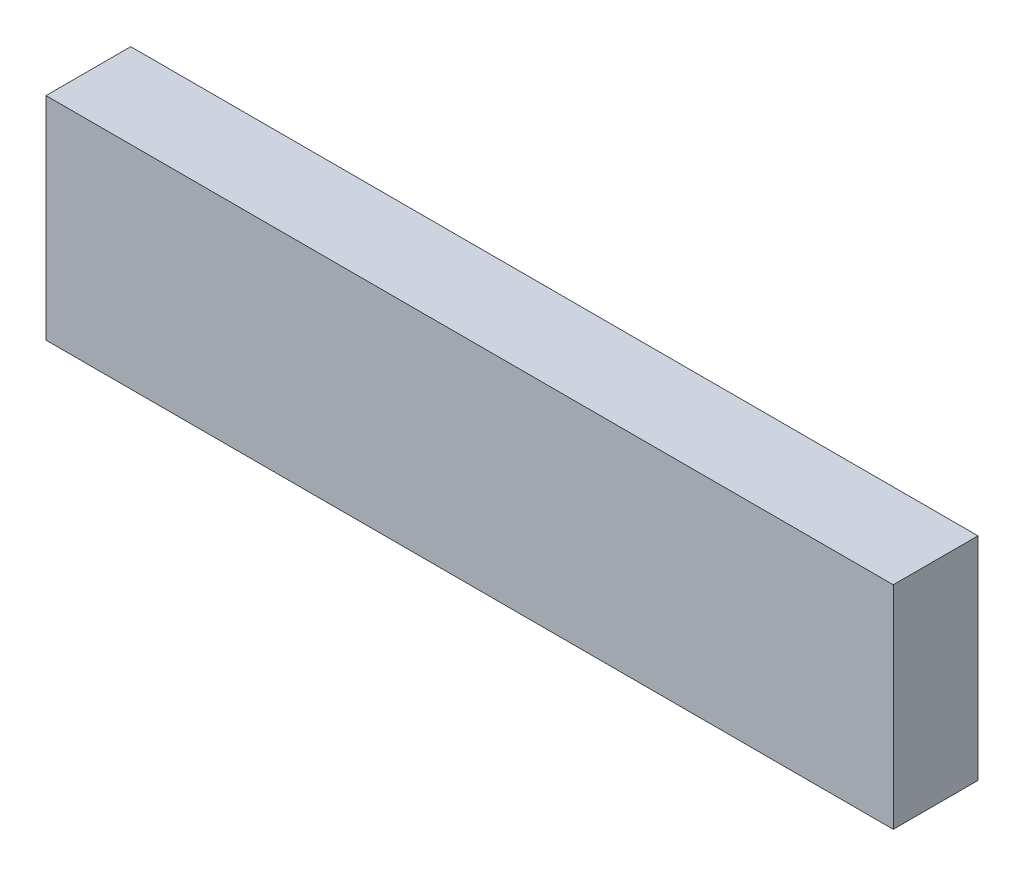
ISO-10303-21;
HEADER;
FILE_DESCRIPTION(('STEP AP214'),'2;1');
FILE_NAME('part.step','',(''),(''),'','','');
FILE_SCHEMA(('AUTOMOTIVE_DESIGN { 1 0 10303 214 1 1 1 1 }'));
ENDSEC;
DATA;
#1=APPLICATION_CONTEXT('core data for automotive mechanical design processes');
#2=APPLICATION_PROTOCOL_DEFINITION('international standard','automotive_design',2000,#1);
#3=PRODUCT_CONTEXT('',#1,'mechanical');
#4=PRODUCT('Part','Part','',(#3));
#5=PRODUCT_RELATED_PRODUCT_CATEGORY('part','',(#4));
#6=PRODUCT_DEFINITION_FORMATION('','',#4);
#7=PRODUCT_DEFINITION_CONTEXT('part definition',#1,'design');
#8=PRODUCT_DEFINITION('design','',#6,#7);
#9=PRODUCT_DEFINITION_SHAPE('','',#8);
#10=(LENGTH_UNIT() NAMED_UNIT(*) SI_UNIT(.MILLI.,.METRE.));
#11=(NAMED_UNIT(*) PLANE_ANGLE_UNIT() SI_UNIT($,.RADIAN.));
#12=(NAMED_UNIT(*) SI_UNIT($,.STERADIAN.) SOLID_ANGLE_UNIT());
#13=UNCERTAINTY_MEASURE_WITH_UNIT(LENGTH_MEASURE(1.E-05),#10,'distance_accuracy_value','');
#14=(GEOMETRIC_REPRESENTATION_CONTEXT(3) GLOBAL_UNCERTAINTY_ASSIGNED_CONTEXT((#13)) GLOBAL_UNIT_ASSIGNED_CONTEXT((#10,
#11,#12)) REPRESENTATION_CONTEXT('',''));
#15=CARTESIAN_POINT('',(0.,0.,0.));
#16=DIRECTION('',(0.,0.,1.));
#17=DIRECTION('',(1.,0.,0.));
#18=AXIS2_PLACEMENT_3D('',#15,#16,#17);
#19=CARTESIAN_POINT('',(-108.,46.99,55.8));
#20=DIRECTION('',(0.,0.,-1.));
#21=DIRECTION('',(-1.,0.,0.));
#22=AXIS2_PLACEMENT_3D('',#19,#20,#21);
#23=PLANE('',#22);
#24=DIRECTION('',(0.,1.,0.));
#25=VECTOR('',#24,1.);
#26=CARTESIAN_POINT('',(-96.,46.99,55.8));
#27=LINE('',#26,#25);
#28=CARTESIAN_POINT('',(-96.,47.,55.8));
#29=VERTEX_POINT('',#28);
#30=CARTESIAN_POINT('',(-96.,50.,55.8));
#31=VERTEX_POINT('',#30);
#32=EDGE_CURVE('E78',#29,#31,#27,.T.);
#33=ORIENTED_EDGE('',*,*,#32,.F.);
#34=DIRECTION('',(-1.,0.,0.));
#35=VECTOR('',#34,1.);
#36=CARTESIAN_POINT('',(300.,47.,55.8));
#37=LINE('',#36,#35);
#38=CARTESIAN_POINT('',(-108.,47.,55.8));
#39=VERTEX_POINT('',#38);
#40=EDGE_CURVE('E11',#29,#39,#37,.T.);
#41=ORIENTED_EDGE('',*,*,#40,.T.);
#42=DIRECTION('',(0.,1.,0.));
#43=VECTOR('',#42,1.);
#44=CARTESIAN_POINT('',(-108.,46.99,55.8));
#45=LINE('',#44,#43);
#46=CARTESIAN_POINT('',(-108.,50.,55.8));
#47=VERTEX_POINT('',#46);
#48=EDGE_CURVE('E39',#39,#47,#45,.T.);
#49=ORIENTED_EDGE('',*,*,#48,.T.);
#50=DIRECTION('',(1.,0.,0.));
#51=VECTOR('',#50,1.);
#52=CARTESIAN_POINT('',(-300.,50.,55.8));
#53=LINE('',#52,#51);
#54=EDGE_CURVE('E82',#47,#31,#53,.T.);
#55=ORIENTED_EDGE('',*,*,#54,.T.);
#56=EDGE_LOOP('',(#33,#41,#49,#55));
#57=FACE_BOUND('',#56,.T.);
#58=ADVANCED_FACE('F35',(#57),#23,.T.);
#59=CARTESIAN_POINT('',(-96.,46.99,55.8));
#60=DIRECTION('',(1.,0.,0.));
#61=DIRECTION('',(0.,0.,-1.));
#62=AXIS2_PLACEMENT_3D('',#59,#60,#61);
#63=PLANE('',#62);
#64=DIRECTION('',(0.,1.,0.));
#65=VECTOR('',#64,1.);
#66=CARTESIAN_POINT('',(-96.,46.99,57.));
#67=LINE('',#66,#65);
#68=CARTESIAN_POINT('',(-96.,47.,57.));
#69=VERTEX_POINT('',#68);
#70=CARTESIAN_POINT('',(-96.,50.,57.));
#71=VERTEX_POINT('',#70);
#72=EDGE_CURVE('E59',#69,#71,#67,.T.);
#73=ORIENTED_EDGE('',*,*,#72,.F.);
#74=DIRECTION('',(0.,0.,-1.));
#75=VECTOR('',#74,1.);
#76=CARTESIAN_POINT('',(-96.,47.,3.));
#77=LINE('',#76,#75);
#78=EDGE_CURVE('E44',#69,#29,#77,.T.);
#79=ORIENTED_EDGE('',*,*,#78,.T.);
#80=ORIENTED_EDGE('',*,*,#32,.T.);
#81=DIRECTION('',(0.,0.,1.));
#82=VECTOR('',#81,1.);
#83=CARTESIAN_POINT('',(-96.,50.,60.));
#84=LINE('',#83,#82);
#85=EDGE_CURVE('E98',#31,#71,#84,.T.);
#86=ORIENTED_EDGE('',*,*,#85,.T.);
#87=EDGE_LOOP('',(#73,#79,#80,#86));
#88=FACE_BOUND('',#87,.T.);
#89=ADVANCED_FACE('F91',(#88),#63,.T.);
#90=CARTESIAN_POINT('',(-108.,46.99,55.8));
#91=DIRECTION('',(-1.,0.,0.));
#92=DIRECTION('',(0.,0.,1.));
#93=AXIS2_PLACEMENT_3D('',#90,#91,#92);
#94=PLANE('',#93);
#95=ORIENTED_EDGE('',*,*,#48,.F.);
#96=DIRECTION('',(0.,0.,1.));
#97=VECTOR('',#96,1.);
#98=CARTESIAN_POINT('',(-108.,47.,3.));
#99=LINE('',#98,#97);
#100=CARTESIAN_POINT('',(-108.,47.,57.));
#101=VERTEX_POINT('',#100);
#102=EDGE_CURVE('E90',#39,#101,#99,.T.);
#103=ORIENTED_EDGE('',*,*,#102,.T.);
#104=DIRECTION('',(0.,1.,0.));
#105=VECTOR('',#104,1.);
#106=CARTESIAN_POINT('',(-108.,46.99,57.));
#107=LINE('',#106,#105);
#108=CARTESIAN_POINT('',(-108.,50.,57.));
#109=VERTEX_POINT('',#108);
#110=EDGE_CURVE('E52',#101,#109,#107,.T.);
#111=ORIENTED_EDGE('',*,*,#110,.T.);
#112=DIRECTION('',(0.,0.,-1.));
#113=VECTOR('',#112,1.);
#114=CARTESIAN_POINT('',(-108.,50.,60.));
#115=LINE('',#114,#113);
#116=EDGE_CURVE('E102',#109,#47,#115,.T.);
#117=ORIENTED_EDGE('',*,*,#116,.T.);
#118=EDGE_LOOP('',(#95,#103,#111,#117));
#119=FACE_BOUND('',#118,.T.);
#120=ADVANCED_FACE('F37',(#119),#94,.T.);
#121=CARTESIAN_POINT('',(-108.,46.99,57.));
#122=DIRECTION('',(0.,0.,1.));
#123=DIRECTION('',(1.,0.,0.));
#124=AXIS2_PLACEMENT_3D('',#121,#122,#123);
#125=PLANE('',#124);
#126=ORIENTED_EDGE('',*,*,#110,.F.);
#127=DIRECTION('',(1.,0.,0.));
#128=VECTOR('',#127,1.);
#129=CARTESIAN_POINT('',(300.,47.,57.));
#130=LINE('',#129,#128);
#131=EDGE_CURVE('E92',#101,#69,#130,.T.);
#132=ORIENTED_EDGE('',*,*,#131,.T.);
#133=ORIENTED_EDGE('',*,*,#72,.T.);
#134=DIRECTION('',(-1.,0.,0.));
#135=VECTOR('',#134,1.);
#136=CARTESIAN_POINT('',(-300.,50.,57.));
#137=LINE('',#136,#135);
#138=EDGE_CURVE('E100',#71,#109,#137,.T.);
#139=ORIENTED_EDGE('',*,*,#138,.T.);
#140=EDGE_LOOP('',(#126,#132,#133,#139));
#141=FACE_BOUND('',#140,.T.);
#142=ADVANCED_FACE('F110',(#141),#125,.T.);
#143=CARTESIAN_POINT('',(300.,47.,3.));
#144=DIRECTION('',(0.,1.,0.));
#145=DIRECTION('',(0.,0.,1.));
#146=AXIS2_PLACEMENT_3D('',#143,#144,#145);
#147=PLANE('',#146);
#148=ORIENTED_EDGE('',*,*,#102,.F.);
#149=ORIENTED_EDGE('',*,*,#40,.F.);
#150=ORIENTED_EDGE('',*,*,#78,.F.);
#151=ORIENTED_EDGE('',*,*,#131,.F.);
#152=EDGE_LOOP('',(#148,#149,#150,#151));
#153=FACE_BOUND('',#152,.T.);
#154=ADVANCED_FACE('F88',(#153),#147,.F.);
#155=CARTESIAN_POINT('',(-300.,50.,60.));
#156=DIRECTION('',(0.,-1.,0.));
#157=DIRECTION('',(0.,0.,-1.));
#158=AXIS2_PLACEMENT_3D('',#155,#156,#157);
#159=PLANE('',#158);
#160=ORIENTED_EDGE('',*,*,#116,.F.);
#161=ORIENTED_EDGE('',*,*,#138,.F.);
#162=ORIENTED_EDGE('',*,*,#85,.F.);
#163=ORIENTED_EDGE('',*,*,#54,.F.);
#164=EDGE_LOOP('',(#160,#161,#162,#163));
#165=FACE_BOUND('',#164,.T.);
#166=ADVANCED_FACE('F107',(#165),#159,.F.);
#167=CLOSED_SHELL('',(#58,#89,#120,#142,#154,#166));
#168=MANIFOLD_SOLID_BREP('B2',#167);
#169=ADVANCED_BREP_SHAPE_REPRESENTATION('',(#18,#168),#14);
#170=SHAPE_DEFINITION_REPRESENTATION(#9,#169);
ENDSEC;
END-ISO-10303-21;
